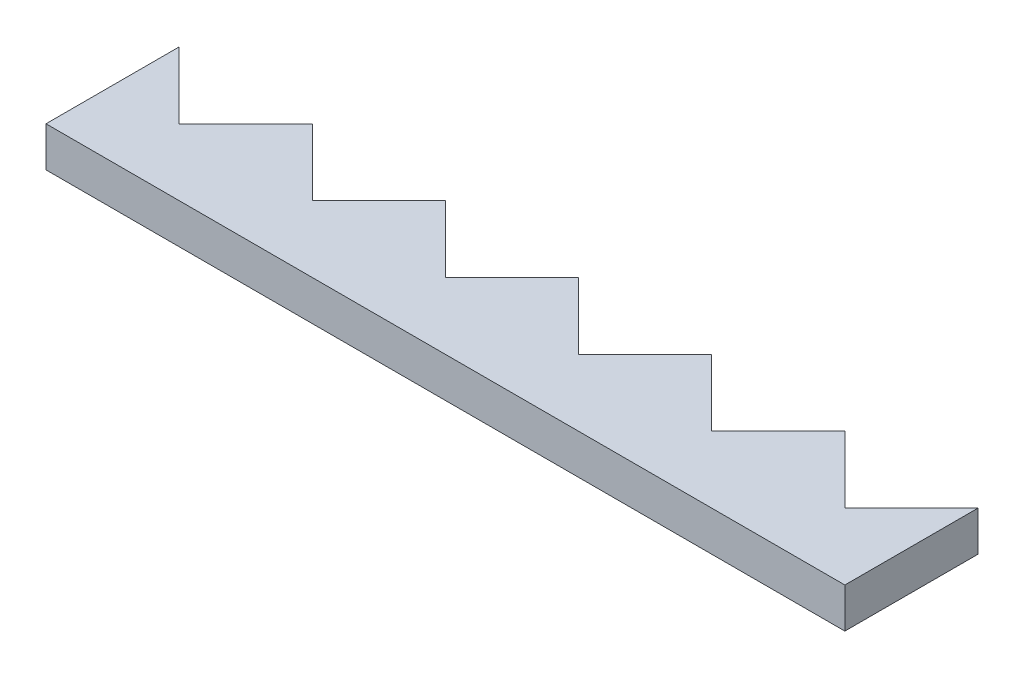
ISO-10303-21;
HEADER;
FILE_DESCRIPTION(('STEP AP214'),'2;1');
FILE_NAME('part.step','',(''),(''),'','','');
FILE_SCHEMA(('AUTOMOTIVE_DESIGN { 1 0 10303 214 1 1 1 1 }'));
ENDSEC;
DATA;
#1=APPLICATION_CONTEXT('core data for automotive mechanical design processes');
#2=APPLICATION_PROTOCOL_DEFINITION('international standard','automotive_design',2000,#1);
#3=PRODUCT_CONTEXT('',#1,'mechanical');
#4=PRODUCT('Part','Part','',(#3));
#5=PRODUCT_RELATED_PRODUCT_CATEGORY('part','',(#4));
#6=PRODUCT_DEFINITION_FORMATION('','',#4);
#7=PRODUCT_DEFINITION_CONTEXT('part definition',#1,'design');
#8=PRODUCT_DEFINITION('design','',#6,#7);
#9=PRODUCT_DEFINITION_SHAPE('','',#8);
#10=(LENGTH_UNIT() NAMED_UNIT(*) SI_UNIT(.MILLI.,.METRE.));
#11=(NAMED_UNIT(*) PLANE_ANGLE_UNIT() SI_UNIT($,.RADIAN.));
#12=(NAMED_UNIT(*) SI_UNIT($,.STERADIAN.) SOLID_ANGLE_UNIT());
#13=UNCERTAINTY_MEASURE_WITH_UNIT(LENGTH_MEASURE(1.E-05),#10,'distance_accuracy_value','');
#14=(GEOMETRIC_REPRESENTATION_CONTEXT(3) GLOBAL_UNCERTAINTY_ASSIGNED_CONTEXT((#13)) GLOBAL_UNIT_ASSIGNED_CONTEXT((#10,
#11,#12)) REPRESENTATION_CONTEXT('',''));
#15=CARTESIAN_POINT('',(0.,0.,0.));
#16=DIRECTION('',(0.,0.,1.));
#17=DIRECTION('',(1.,0.,0.));
#18=AXIS2_PLACEMENT_3D('',#15,#16,#17);
#19=CARTESIAN_POINT('',(0.,3.33025149712782,0.));
#20=DIRECTION('',(0.,0.,-1.));
#21=DIRECTION('',(-1.,0.,0.));
#22=AXIS2_PLACEMENT_3D('',#19,#20,#21);
#23=PLANE('',#22);
#24=DIRECTION('',(1.,0.,0.));
#25=VECTOR('',#24,1.);
#26=CARTESIAN_POINT('',(0.,0.330251497127817,0.));
#27=LINE('',#26,#25);
#28=CARTESIAN_POINT('',(0.,0.330251497127817,0.));
#29=VERTEX_POINT('',#28);
#30=CARTESIAN_POINT('',(60.,0.330251497127817,0.));
#31=VERTEX_POINT('',#30);
#32=EDGE_CURVE('E171',#29,#31,#27,.T.);
#33=ORIENTED_EDGE('',*,*,#32,.T.);
#34=DIRECTION('',(0.,-1.,0.));
#35=VECTOR('',#34,1.);
#36=CARTESIAN_POINT('',(60.,3.33025149712782,0.));
#37=LINE('',#36,#35);
#38=CARTESIAN_POINT('',(60.,3.33025149712782,0.));
#39=VERTEX_POINT('',#38);
#40=EDGE_CURVE('E11',#39,#31,#37,.T.);
#41=ORIENTED_EDGE('',*,*,#40,.F.);
#42=DIRECTION('',(1.,0.,0.));
#43=VECTOR('',#42,1.);
#44=CARTESIAN_POINT('',(0.,3.33025149712782,0.));
#45=LINE('',#44,#43);
#46=CARTESIAN_POINT('',(0.,3.33025149712782,0.));
#47=VERTEX_POINT('',#46);
#48=EDGE_CURVE('E199',#47,#39,#45,.T.);
#49=ORIENTED_EDGE('',*,*,#48,.F.);
#50=DIRECTION('',(0.,-1.,0.));
#51=VECTOR('',#50,1.);
#52=CARTESIAN_POINT('',(0.,3.33025149712782,0.));
#53=LINE('',#52,#51);
#54=EDGE_CURVE('E167',#47,#29,#53,.T.);
#55=ORIENTED_EDGE('',*,*,#54,.T.);
#56=EDGE_LOOP('',(#33,#41,#49,#55));
#57=FACE_BOUND('',#56,.T.);
#58=ADVANCED_FACE('F33',(#57),#23,.F.);
#59=CARTESIAN_POINT('',(60.,3.33025149712782,0.));
#60=DIRECTION('',(-1.,0.,0.));
#61=DIRECTION('',(0.,0.,1.));
#62=AXIS2_PLACEMENT_3D('',#59,#60,#61);
#63=PLANE('',#62);
#64=DIRECTION('',(0.,0.,-1.));
#65=VECTOR('',#64,1.);
#66=CARTESIAN_POINT('',(60.,0.330251497127817,0.));
#67=LINE('',#66,#65);
#68=CARTESIAN_POINT('',(60.,0.330251497127817,-10.));
#69=VERTEX_POINT('',#68);
#70=EDGE_CURVE('E174',#31,#69,#67,.T.);
#71=ORIENTED_EDGE('',*,*,#70,.T.);
#72=DIRECTION('',(0.,-1.,0.));
#73=VECTOR('',#72,1.);
#74=CARTESIAN_POINT('',(60.,3.33025149712782,-10.));
#75=LINE('',#74,#73);
#76=CARTESIAN_POINT('',(60.,3.33025149712782,-10.));
#77=VERTEX_POINT('',#76);
#78=EDGE_CURVE('E41',#77,#69,#75,.T.);
#79=ORIENTED_EDGE('',*,*,#78,.F.);
#80=DIRECTION('',(0.,0.,-1.));
#81=VECTOR('',#80,1.);
#82=CARTESIAN_POINT('',(60.,3.33025149712782,0.));
#83=LINE('',#82,#81);
#84=EDGE_CURVE('E113',#39,#77,#83,.T.);
#85=ORIENTED_EDGE('',*,*,#84,.F.);
#86=ORIENTED_EDGE('',*,*,#40,.T.);
#87=EDGE_LOOP('',(#71,#79,#85,#86));
#88=FACE_BOUND('',#87,.T.);
#89=ADVANCED_FACE('F292',(#88),#63,.F.);
#90=CARTESIAN_POINT('',(55.,3.33025149712782,-5.));
#91=DIRECTION('',(0.707106781186547,0.,0.707106781186548));
#92=DIRECTION('',(0.707106781186548,0.,-0.707106781186547));
#93=AXIS2_PLACEMENT_3D('',#90,#91,#92);
#94=PLANE('',#93);
#95=DIRECTION('',(-0.707106781186548,0.,0.707106781186547));
#96=VECTOR('',#95,1.);
#97=CARTESIAN_POINT('',(55.,0.330251497127817,-5.));
#98=LINE('',#97,#96);
#99=CARTESIAN_POINT('',(55.,0.330251497127817,-5.));
#100=VERTEX_POINT('',#99);
#101=EDGE_CURVE('E176',#69,#100,#98,.T.);
#102=ORIENTED_EDGE('',*,*,#101,.T.);
#103=DIRECTION('',(0.,-1.,0.));
#104=VECTOR('',#103,1.);
#105=CARTESIAN_POINT('',(55.,3.33025149712782,-5.));
#106=LINE('',#105,#104);
#107=CARTESIAN_POINT('',(55.,3.33025149712782,-5.));
#108=VERTEX_POINT('',#107);
#109=EDGE_CURVE('E227',#108,#100,#106,.T.);
#110=ORIENTED_EDGE('',*,*,#109,.F.);
#111=DIRECTION('',(-0.707106781186548,0.,0.707106781186547));
#112=VECTOR('',#111,1.);
#113=CARTESIAN_POINT('',(55.,3.33025149712782,-5.));
#114=LINE('',#113,#112);
#115=EDGE_CURVE('E235',#77,#108,#114,.T.);
#116=ORIENTED_EDGE('',*,*,#115,.F.);
#117=ORIENTED_EDGE('',*,*,#78,.T.);
#118=EDGE_LOOP('',(#102,#110,#116,#117));
#119=FACE_BOUND('',#118,.T.);
#120=ADVANCED_FACE('F233',(#119),#94,.F.);
#121=CARTESIAN_POINT('',(50.,3.33025149712782,-10.));
#122=DIRECTION('',(-0.707106781186548,0.,0.707106781186547));
#123=DIRECTION('',(0.707106781186547,0.,0.707106781186548));
#124=AXIS2_PLACEMENT_3D('',#121,#122,#123);
#125=PLANE('',#124);
#126=DIRECTION('',(-0.707106781186547,0.,-0.707106781186548));
#127=VECTOR('',#126,1.);
#128=CARTESIAN_POINT('',(50.,0.330251497127817,-10.));
#129=LINE('',#128,#127);
#130=CARTESIAN_POINT('',(50.,0.330251497127817,-10.));
#131=VERTEX_POINT('',#130);
#132=EDGE_CURVE('E178',#100,#131,#129,.T.);
#133=ORIENTED_EDGE('',*,*,#132,.T.);
#134=DIRECTION('',(0.,-1.,0.));
#135=VECTOR('',#134,1.);
#136=CARTESIAN_POINT('',(50.,3.33025149712782,-10.));
#137=LINE('',#136,#135);
#138=CARTESIAN_POINT('',(50.,3.33025149712782,-10.));
#139=VERTEX_POINT('',#138);
#140=EDGE_CURVE('E224',#139,#131,#137,.T.);
#141=ORIENTED_EDGE('',*,*,#140,.F.);
#142=DIRECTION('',(-0.707106781186547,0.,-0.707106781186548));
#143=VECTOR('',#142,1.);
#144=CARTESIAN_POINT('',(50.,3.33025149712782,-10.));
#145=LINE('',#144,#143);
#146=EDGE_CURVE('E253',#108,#139,#145,.T.);
#147=ORIENTED_EDGE('',*,*,#146,.F.);
#148=ORIENTED_EDGE('',*,*,#109,.T.);
#149=EDGE_LOOP('',(#133,#141,#147,#148));
#150=FACE_BOUND('',#149,.T.);
#151=ADVANCED_FACE('F244',(#150),#125,.F.);
#152=CARTESIAN_POINT('',(45.,3.33025149712782,-5.));
#153=DIRECTION('',(0.707106781186548,0.,0.707106781186547));
#154=DIRECTION('',(0.707106781186547,0.,-0.707106781186548));
#155=AXIS2_PLACEMENT_3D('',#152,#153,#154);
#156=PLANE('',#155);
#157=DIRECTION('',(-0.707106781186547,0.,0.707106781186548));
#158=VECTOR('',#157,1.);
#159=CARTESIAN_POINT('',(45.,0.330251497127817,-5.));
#160=LINE('',#159,#158);
#161=CARTESIAN_POINT('',(45.,0.330251497127817,-5.));
#162=VERTEX_POINT('',#161);
#163=EDGE_CURVE('E180',#131,#162,#160,.T.);
#164=ORIENTED_EDGE('',*,*,#163,.T.);
#165=DIRECTION('',(0.,-1.,0.));
#166=VECTOR('',#165,1.);
#167=CARTESIAN_POINT('',(45.,3.33025149712782,-5.));
#168=LINE('',#167,#166);
#169=CARTESIAN_POINT('',(45.,3.33025149712782,-5.));
#170=VERTEX_POINT('',#169);
#171=EDGE_CURVE('E221',#170,#162,#168,.T.);
#172=ORIENTED_EDGE('',*,*,#171,.F.);
#173=DIRECTION('',(-0.707106781186547,0.,0.707106781186548));
#174=VECTOR('',#173,1.);
#175=CARTESIAN_POINT('',(45.,3.33025149712782,-5.));
#176=LINE('',#175,#174);
#177=EDGE_CURVE('E250',#139,#170,#176,.T.);
#178=ORIENTED_EDGE('',*,*,#177,.F.);
#179=ORIENTED_EDGE('',*,*,#140,.T.);
#180=EDGE_LOOP('',(#164,#172,#178,#179));
#181=FACE_BOUND('',#180,.T.);
#182=ADVANCED_FACE('F248',(#181),#156,.F.);
#183=CARTESIAN_POINT('',(40.,3.33025149712782,-10.));
#184=DIRECTION('',(-0.707106781186548,0.,0.707106781186547));
#185=DIRECTION('',(0.707106781186547,0.,0.707106781186548));
#186=AXIS2_PLACEMENT_3D('',#183,#184,#185);
#187=PLANE('',#186);
#188=DIRECTION('',(-0.707106781186547,0.,-0.707106781186548));
#189=VECTOR('',#188,1.);
#190=CARTESIAN_POINT('',(40.,0.330251497127817,-10.));
#191=LINE('',#190,#189);
#192=CARTESIAN_POINT('',(40.,0.330251497127817,-10.));
#193=VERTEX_POINT('',#192);
#194=EDGE_CURVE('E182',#162,#193,#191,.T.);
#195=ORIENTED_EDGE('',*,*,#194,.T.);
#196=DIRECTION('',(0.,-1.,0.));
#197=VECTOR('',#196,1.);
#198=CARTESIAN_POINT('',(40.,3.33025149712782,-10.));
#199=LINE('',#198,#197);
#200=CARTESIAN_POINT('',(40.,3.33025149712782,-10.));
#201=VERTEX_POINT('',#200);
#202=EDGE_CURVE('E218',#201,#193,#199,.T.);
#203=ORIENTED_EDGE('',*,*,#202,.F.);
#204=DIRECTION('',(-0.707106781186547,0.,-0.707106781186548));
#205=VECTOR('',#204,1.);
#206=CARTESIAN_POINT('',(40.,3.33025149712782,-10.));
#207=LINE('',#206,#205);
#208=EDGE_CURVE('E252',#170,#201,#207,.T.);
#209=ORIENTED_EDGE('',*,*,#208,.F.);
#210=ORIENTED_EDGE('',*,*,#171,.T.);
#211=EDGE_LOOP('',(#195,#203,#209,#210));
#212=FACE_BOUND('',#211,.T.);
#213=ADVANCED_FACE('F305',(#212),#187,.F.);
#214=CARTESIAN_POINT('',(35.,3.33025149712782,-5.));
#215=DIRECTION('',(0.707106781186547,0.,0.707106781186548));
#216=DIRECTION('',(0.707106781186548,0.,-0.707106781186547));
#217=AXIS2_PLACEMENT_3D('',#214,#215,#216);
#218=PLANE('',#217);
#219=DIRECTION('',(-0.707106781186548,0.,0.707106781186547));
#220=VECTOR('',#219,1.);
#221=CARTESIAN_POINT('',(35.,0.330251497127817,-5.));
#222=LINE('',#221,#220);
#223=CARTESIAN_POINT('',(35.,0.330251497127817,-5.));
#224=VERTEX_POINT('',#223);
#225=EDGE_CURVE('E184',#193,#224,#222,.T.);
#226=ORIENTED_EDGE('',*,*,#225,.T.);
#227=DIRECTION('',(0.,-1.,0.));
#228=VECTOR('',#227,1.);
#229=CARTESIAN_POINT('',(35.,3.33025149712782,-5.));
#230=LINE('',#229,#228);
#231=CARTESIAN_POINT('',(35.,3.33025149712782,-5.));
#232=VERTEX_POINT('',#231);
#233=EDGE_CURVE('E215',#232,#224,#230,.T.);
#234=ORIENTED_EDGE('',*,*,#233,.F.);
#235=DIRECTION('',(-0.707106781186548,0.,0.707106781186547));
#236=VECTOR('',#235,1.);
#237=CARTESIAN_POINT('',(35.,3.33025149712782,-5.));
#238=LINE('',#237,#236);
#239=EDGE_CURVE('E255',#201,#232,#238,.T.);
#240=ORIENTED_EDGE('',*,*,#239,.F.);
#241=ORIENTED_EDGE('',*,*,#202,.T.);
#242=EDGE_LOOP('',(#226,#234,#240,#241));
#243=FACE_BOUND('',#242,.T.);
#244=ADVANCED_FACE('F308',(#243),#218,.F.);
#245=CARTESIAN_POINT('',(30.,3.33025149712782,-10.));
#246=DIRECTION('',(-0.707106781186548,0.,0.707106781186547));
#247=DIRECTION('',(0.707106781186547,0.,0.707106781186548));
#248=AXIS2_PLACEMENT_3D('',#245,#246,#247);
#249=PLANE('',#248);
#250=DIRECTION('',(-0.707106781186547,0.,-0.707106781186548));
#251=VECTOR('',#250,1.);
#252=CARTESIAN_POINT('',(30.,0.330251497127817,-10.));
#253=LINE('',#252,#251);
#254=CARTESIAN_POINT('',(30.,0.330251497127817,-10.));
#255=VERTEX_POINT('',#254);
#256=EDGE_CURVE('E186',#224,#255,#253,.T.);
#257=ORIENTED_EDGE('',*,*,#256,.T.);
#258=DIRECTION('',(0.,-1.,0.));
#259=VECTOR('',#258,1.);
#260=CARTESIAN_POINT('',(30.,3.33025149712782,-10.));
#261=LINE('',#260,#259);
#262=CARTESIAN_POINT('',(30.,3.33025149712782,-10.));
#263=VERTEX_POINT('',#262);
#264=EDGE_CURVE('E212',#263,#255,#261,.T.);
#265=ORIENTED_EDGE('',*,*,#264,.F.);
#266=DIRECTION('',(-0.707106781186547,0.,-0.707106781186548));
#267=VECTOR('',#266,1.);
#268=CARTESIAN_POINT('',(30.,3.33025149712782,-10.));
#269=LINE('',#268,#267);
#270=EDGE_CURVE('E261',#232,#263,#269,.T.);
#271=ORIENTED_EDGE('',*,*,#270,.F.);
#272=ORIENTED_EDGE('',*,*,#233,.T.);
#273=EDGE_LOOP('',(#257,#265,#271,#272));
#274=FACE_BOUND('',#273,.T.);
#275=ADVANCED_FACE('F312',(#274),#249,.F.);
#276=CARTESIAN_POINT('',(25.,3.33025149712782,-5.));
#277=DIRECTION('',(0.707106781186548,0.,0.707106781186547));
#278=DIRECTION('',(0.707106781186547,0.,-0.707106781186548));
#279=AXIS2_PLACEMENT_3D('',#276,#277,#278);
#280=PLANE('',#279);
#281=DIRECTION('',(-0.707106781186547,0.,0.707106781186548));
#282=VECTOR('',#281,1.);
#283=CARTESIAN_POINT('',(25.,0.330251497127817,-5.));
#284=LINE('',#283,#282);
#285=CARTESIAN_POINT('',(25.,0.330251497127817,-5.));
#286=VERTEX_POINT('',#285);
#287=EDGE_CURVE('E188',#255,#286,#284,.T.);
#288=ORIENTED_EDGE('',*,*,#287,.T.);
#289=DIRECTION('',(0.,-1.,0.));
#290=VECTOR('',#289,1.);
#291=CARTESIAN_POINT('',(25.,3.33025149712782,-5.));
#292=LINE('',#291,#290);
#293=CARTESIAN_POINT('',(25.,3.33025149712782,-5.));
#294=VERTEX_POINT('',#293);
#295=EDGE_CURVE('E209',#294,#286,#292,.T.);
#296=ORIENTED_EDGE('',*,*,#295,.F.);
#297=DIRECTION('',(-0.707106781186547,0.,0.707106781186548));
#298=VECTOR('',#297,1.);
#299=CARTESIAN_POINT('',(25.,3.33025149712782,-5.));
#300=LINE('',#299,#298);
#301=EDGE_CURVE('E263',#263,#294,#300,.T.);
#302=ORIENTED_EDGE('',*,*,#301,.F.);
#303=ORIENTED_EDGE('',*,*,#264,.T.);
#304=EDGE_LOOP('',(#288,#296,#302,#303));
#305=FACE_BOUND('',#304,.T.);
#306=ADVANCED_FACE('F316',(#305),#280,.F.);
#307=CARTESIAN_POINT('',(20.,3.33025149712782,-10.));
#308=DIRECTION('',(-0.707106781186547,0.,0.707106781186548));
#309=DIRECTION('',(0.707106781186548,0.,0.707106781186547));
#310=AXIS2_PLACEMENT_3D('',#307,#308,#309);
#311=PLANE('',#310);
#312=DIRECTION('',(-0.707106781186548,0.,-0.707106781186547));
#313=VECTOR('',#312,1.);
#314=CARTESIAN_POINT('',(20.,0.330251497127817,-10.));
#315=LINE('',#314,#313);
#316=CARTESIAN_POINT('',(20.,0.330251497127817,-10.));
#317=VERTEX_POINT('',#316);
#318=EDGE_CURVE('E190',#286,#317,#315,.T.);
#319=ORIENTED_EDGE('',*,*,#318,.T.);
#320=DIRECTION('',(0.,-1.,0.));
#321=VECTOR('',#320,1.);
#322=CARTESIAN_POINT('',(20.,3.33025149712782,-10.));
#323=LINE('',#322,#321);
#324=CARTESIAN_POINT('',(20.,3.33025149712782,-10.));
#325=VERTEX_POINT('',#324);
#326=EDGE_CURVE('E206',#325,#317,#323,.T.);
#327=ORIENTED_EDGE('',*,*,#326,.F.);
#328=DIRECTION('',(-0.707106781186548,0.,-0.707106781186547));
#329=VECTOR('',#328,1.);
#330=CARTESIAN_POINT('',(20.,3.33025149712782,-10.));
#331=LINE('',#330,#329);
#332=EDGE_CURVE('E265',#294,#325,#331,.T.);
#333=ORIENTED_EDGE('',*,*,#332,.F.);
#334=ORIENTED_EDGE('',*,*,#295,.T.);
#335=EDGE_LOOP('',(#319,#327,#333,#334));
#336=FACE_BOUND('',#335,.T.);
#337=ADVANCED_FACE('F320',(#336),#311,.F.);
#338=CARTESIAN_POINT('',(15.,3.33025149712782,-5.));
#339=DIRECTION('',(0.707106781186547,0.,0.707106781186548));
#340=DIRECTION('',(0.707106781186548,0.,-0.707106781186547));
#341=AXIS2_PLACEMENT_3D('',#338,#339,#340);
#342=PLANE('',#341);
#343=DIRECTION('',(-0.707106781186548,0.,0.707106781186547));
#344=VECTOR('',#343,1.);
#345=CARTESIAN_POINT('',(15.,0.330251497127817,-5.));
#346=LINE('',#345,#344);
#347=CARTESIAN_POINT('',(15.,0.330251497127817,-5.));
#348=VERTEX_POINT('',#347);
#349=EDGE_CURVE('E192',#317,#348,#346,.T.);
#350=ORIENTED_EDGE('',*,*,#349,.T.);
#351=DIRECTION('',(0.,-1.,0.));
#352=VECTOR('',#351,1.);
#353=CARTESIAN_POINT('',(15.,3.33025149712782,-5.));
#354=LINE('',#353,#352);
#355=CARTESIAN_POINT('',(15.,3.33025149712782,-5.));
#356=VERTEX_POINT('',#355);
#357=EDGE_CURVE('E203',#356,#348,#354,.T.);
#358=ORIENTED_EDGE('',*,*,#357,.F.);
#359=DIRECTION('',(-0.707106781186548,0.,0.707106781186547));
#360=VECTOR('',#359,1.);
#361=CARTESIAN_POINT('',(15.,3.33025149712782,-5.));
#362=LINE('',#361,#360);
#363=EDGE_CURVE('E267',#325,#356,#362,.T.);
#364=ORIENTED_EDGE('',*,*,#363,.F.);
#365=ORIENTED_EDGE('',*,*,#326,.T.);
#366=EDGE_LOOP('',(#350,#358,#364,#365));
#367=FACE_BOUND('',#366,.T.);
#368=ADVANCED_FACE('F273',(#367),#342,.F.);
#369=CARTESIAN_POINT('',(10.,3.33025149712782,-10.));
#370=DIRECTION('',(-0.707106781186548,0.,0.707106781186547));
#371=DIRECTION('',(0.707106781186547,0.,0.707106781186548));
#372=AXIS2_PLACEMENT_3D('',#369,#370,#371);
#373=PLANE('',#372);
#374=DIRECTION('',(-0.707106781186547,0.,-0.707106781186548));
#375=VECTOR('',#374,1.);
#376=CARTESIAN_POINT('',(10.,0.330251497127817,-10.));
#377=LINE('',#376,#375);
#378=CARTESIAN_POINT('',(10.,0.330251497127817,-10.));
#379=VERTEX_POINT('',#378);
#380=EDGE_CURVE('E194',#348,#379,#377,.T.);
#381=ORIENTED_EDGE('',*,*,#380,.T.);
#382=DIRECTION('',(0.,-1.,0.));
#383=VECTOR('',#382,1.);
#384=CARTESIAN_POINT('',(10.,3.33025149712782,-10.));
#385=LINE('',#384,#383);
#386=CARTESIAN_POINT('',(10.,3.33025149712782,-10.));
#387=VERTEX_POINT('',#386);
#388=EDGE_CURVE('E162',#387,#379,#385,.T.);
#389=ORIENTED_EDGE('',*,*,#388,.F.);
#390=DIRECTION('',(-0.707106781186547,0.,-0.707106781186548));
#391=VECTOR('',#390,1.);
#392=CARTESIAN_POINT('',(10.,3.33025149712782,-10.));
#393=LINE('',#392,#391);
#394=EDGE_CURVE('E153',#356,#387,#393,.T.);
#395=ORIENTED_EDGE('',*,*,#394,.F.);
#396=ORIENTED_EDGE('',*,*,#357,.T.);
#397=EDGE_LOOP('',(#381,#389,#395,#396));
#398=FACE_BOUND('',#397,.T.);
#399=ADVANCED_FACE('F277',(#398),#373,.F.);
#400=CARTESIAN_POINT('',(5.,3.33025149712782,-5.));
#401=DIRECTION('',(0.707106781186547,0.,0.707106781186547));
#402=DIRECTION('',(0.707106781186548,0.,-0.707106781186548));
#403=AXIS2_PLACEMENT_3D('',#400,#401,#402);
#404=PLANE('',#403);
#405=DIRECTION('',(-0.707106781186548,0.,0.707106781186548));
#406=VECTOR('',#405,1.);
#407=CARTESIAN_POINT('',(5.,0.330251497127817,-5.));
#408=LINE('',#407,#406);
#409=CARTESIAN_POINT('',(5.,0.330251497127817,-5.));
#410=VERTEX_POINT('',#409);
#411=EDGE_CURVE('E161',#379,#410,#408,.T.);
#412=ORIENTED_EDGE('',*,*,#411,.T.);
#413=DIRECTION('',(0.,-1.,0.));
#414=VECTOR('',#413,1.);
#415=CARTESIAN_POINT('',(5.,3.33025149712782,-5.));
#416=LINE('',#415,#414);
#417=CARTESIAN_POINT('',(5.,3.33025149712782,-5.));
#418=VERTEX_POINT('',#417);
#419=EDGE_CURVE('E158',#418,#410,#416,.T.);
#420=ORIENTED_EDGE('',*,*,#419,.F.);
#421=DIRECTION('',(-0.707106781186548,0.,0.707106781186548));
#422=VECTOR('',#421,1.);
#423=CARTESIAN_POINT('',(5.,3.33025149712782,-5.));
#424=LINE('',#423,#422);
#425=EDGE_CURVE('E147',#387,#418,#424,.T.);
#426=ORIENTED_EDGE('',*,*,#425,.F.);
#427=ORIENTED_EDGE('',*,*,#388,.T.);
#428=EDGE_LOOP('',(#412,#420,#426,#427));
#429=FACE_BOUND('',#428,.T.);
#430=ADVANCED_FACE('F159',(#429),#404,.F.);
#431=CARTESIAN_POINT('',(0.,3.33025149712782,-10.));
#432=DIRECTION('',(-0.707106781186547,0.,0.707106781186547));
#433=DIRECTION('',(0.707106781186548,0.,0.707106781186548));
#434=AXIS2_PLACEMENT_3D('',#431,#432,#433);
#435=PLANE('',#434);
#436=DIRECTION('',(-0.707106781186548,0.,-0.707106781186548));
#437=VECTOR('',#436,1.);
#438=CARTESIAN_POINT('',(0.,0.330251497127817,-10.));
#439=LINE('',#438,#437);
#440=CARTESIAN_POINT('',(0.,0.330251497127817,-10.));
#441=VERTEX_POINT('',#440);
#442=EDGE_CURVE('E99',#410,#441,#439,.T.);
#443=ORIENTED_EDGE('',*,*,#442,.T.);
#444=DIRECTION('',(0.,-1.,0.));
#445=VECTOR('',#444,1.);
#446=CARTESIAN_POINT('',(0.,3.33025149712782,-10.));
#447=LINE('',#446,#445);
#448=CARTESIAN_POINT('',(0.,3.33025149712782,-10.));
#449=VERTEX_POINT('',#448);
#450=EDGE_CURVE('E163',#449,#441,#447,.T.);
#451=ORIENTED_EDGE('',*,*,#450,.F.);
#452=DIRECTION('',(-0.707106781186548,0.,-0.707106781186548));
#453=VECTOR('',#452,1.);
#454=CARTESIAN_POINT('',(0.,3.33025149712782,-10.));
#455=LINE('',#454,#453);
#456=EDGE_CURVE('E151',#418,#449,#455,.T.);
#457=ORIENTED_EDGE('',*,*,#456,.F.);
#458=ORIENTED_EDGE('',*,*,#419,.T.);
#459=EDGE_LOOP('',(#443,#451,#457,#458));
#460=FACE_BOUND('',#459,.T.);
#461=ADVANCED_FACE('F165',(#460),#435,.F.);
#462=CARTESIAN_POINT('',(0.,3.33025149712782,0.));
#463=DIRECTION('',(1.,0.,0.));
#464=DIRECTION('',(0.,0.,-1.));
#465=AXIS2_PLACEMENT_3D('',#462,#463,#464);
#466=PLANE('',#465);
#467=DIRECTION('',(0.,0.,1.));
#468=VECTOR('',#467,1.);
#469=CARTESIAN_POINT('',(0.,0.330251497127817,0.));
#470=LINE('',#469,#468);
#471=EDGE_CURVE('E105',#441,#29,#470,.T.);
#472=ORIENTED_EDGE('',*,*,#471,.T.);
#473=ORIENTED_EDGE('',*,*,#54,.F.);
#474=DIRECTION('',(0.,0.,1.));
#475=VECTOR('',#474,1.);
#476=CARTESIAN_POINT('',(0.,3.33025149712782,0.));
#477=LINE('',#476,#475);
#478=EDGE_CURVE('E49',#449,#47,#477,.T.);
#479=ORIENTED_EDGE('',*,*,#478,.F.);
#480=ORIENTED_EDGE('',*,*,#450,.T.);
#481=EDGE_LOOP('',(#472,#473,#479,#480));
#482=FACE_BOUND('',#481,.T.);
#483=ADVANCED_FACE('F281',(#482),#466,.F.);
#484=CARTESIAN_POINT('',(0.,3.33025149712782,0.));
#485=DIRECTION('',(0.,1.,0.));
#486=DIRECTION('',(0.,0.,1.));
#487=AXIS2_PLACEMENT_3D('',#484,#485,#486);
#488=PLANE('',#487);
#489=ORIENTED_EDGE('',*,*,#48,.T.);
#490=ORIENTED_EDGE('',*,*,#84,.T.);
#491=ORIENTED_EDGE('',*,*,#115,.T.);
#492=ORIENTED_EDGE('',*,*,#146,.T.);
#493=ORIENTED_EDGE('',*,*,#177,.T.);
#494=ORIENTED_EDGE('',*,*,#208,.T.);
#495=ORIENTED_EDGE('',*,*,#239,.T.);
#496=ORIENTED_EDGE('',*,*,#270,.T.);
#497=ORIENTED_EDGE('',*,*,#301,.T.);
#498=ORIENTED_EDGE('',*,*,#332,.T.);
#499=ORIENTED_EDGE('',*,*,#363,.T.);
#500=ORIENTED_EDGE('',*,*,#394,.T.);
#501=ORIENTED_EDGE('',*,*,#425,.T.);
#502=ORIENTED_EDGE('',*,*,#456,.T.);
#503=ORIENTED_EDGE('',*,*,#478,.T.);
#504=EDGE_LOOP('',(#489,#490,#491,#492,#493,#494,#495,#496,#497,#498,#499,#500,#501,#502,#503));
#505=FACE_BOUND('',#504,.T.);
#506=ADVANCED_FACE('F149',(#505),#488,.T.);
#507=CARTESIAN_POINT('',(0.,0.330251497127817,0.));
#508=DIRECTION('',(0.,1.,0.));
#509=DIRECTION('',(0.,0.,1.));
#510=AXIS2_PLACEMENT_3D('',#507,#508,#509);
#511=PLANE('',#510);
#512=ORIENTED_EDGE('',*,*,#32,.F.);
#513=ORIENTED_EDGE('',*,*,#471,.F.);
#514=ORIENTED_EDGE('',*,*,#442,.F.);
#515=ORIENTED_EDGE('',*,*,#411,.F.);
#516=ORIENTED_EDGE('',*,*,#380,.F.);
#517=ORIENTED_EDGE('',*,*,#349,.F.);
#518=ORIENTED_EDGE('',*,*,#318,.F.);
#519=ORIENTED_EDGE('',*,*,#287,.F.);
#520=ORIENTED_EDGE('',*,*,#256,.F.);
#521=ORIENTED_EDGE('',*,*,#225,.F.);
#522=ORIENTED_EDGE('',*,*,#194,.F.);
#523=ORIENTED_EDGE('',*,*,#163,.F.);
#524=ORIENTED_EDGE('',*,*,#132,.F.);
#525=ORIENTED_EDGE('',*,*,#101,.F.);
#526=ORIENTED_EDGE('',*,*,#70,.F.);
#527=EDGE_LOOP('',(#512,#513,#514,#515,#516,#517,#518,#519,#520,#521,#522,#523,#524,#525,#526));
#528=FACE_BOUND('',#527,.T.);
#529=ADVANCED_FACE('F239',(#528),#511,.F.);
#530=CLOSED_SHELL('',(#58,#89,#120,#151,#182,#213,#244,#275,#306,#337,#368,#399,#430,#461,#483,
#506,#529));
#531=MANIFOLD_SOLID_BREP('B2',#530);
#532=ADVANCED_BREP_SHAPE_REPRESENTATION('',(#18,#531),#14);
#533=SHAPE_DEFINITION_REPRESENTATION(#9,#532);
ENDSEC;
END-ISO-10303-21;
